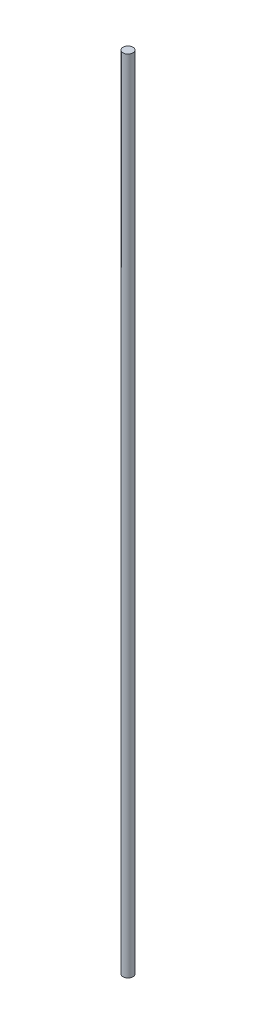
ISO-10303-21;
HEADER;
FILE_DESCRIPTION(('STEP AP214'),'2;1');
FILE_NAME('part.step','',(''),(''),'','','');
FILE_SCHEMA(('AUTOMOTIVE_DESIGN { 1 0 10303 214 1 1 1 1 }'));
ENDSEC;
DATA;
#1=APPLICATION_CONTEXT('core data for automotive mechanical design processes');
#2=APPLICATION_PROTOCOL_DEFINITION('international standard','automotive_design',2000,#1);
#3=PRODUCT_CONTEXT('',#1,'mechanical');
#4=PRODUCT('Part','Part','',(#3));
#5=PRODUCT_RELATED_PRODUCT_CATEGORY('part','',(#4));
#6=PRODUCT_DEFINITION_FORMATION('','',#4);
#7=PRODUCT_DEFINITION_CONTEXT('part definition',#1,'design');
#8=PRODUCT_DEFINITION('design','',#6,#7);
#9=PRODUCT_DEFINITION_SHAPE('','',#8);
#10=(LENGTH_UNIT() NAMED_UNIT(*) SI_UNIT(.MILLI.,.METRE.));
#11=(NAMED_UNIT(*) PLANE_ANGLE_UNIT() SI_UNIT($,.RADIAN.));
#12=(NAMED_UNIT(*) SI_UNIT($,.STERADIAN.) SOLID_ANGLE_UNIT());
#13=UNCERTAINTY_MEASURE_WITH_UNIT(LENGTH_MEASURE(1.E-05),#10,'distance_accuracy_value','');
#14=(GEOMETRIC_REPRESENTATION_CONTEXT(3) GLOBAL_UNCERTAINTY_ASSIGNED_CONTEXT((#13)) GLOBAL_UNIT_ASSIGNED_CONTEXT((#10,
#11,#12)) REPRESENTATION_CONTEXT('',''));
#15=CARTESIAN_POINT('',(0.,0.,0.));
#16=DIRECTION('',(0.,0.,1.));
#17=DIRECTION('',(1.,0.,0.));
#18=AXIS2_PLACEMENT_3D('',#15,#16,#17);
#19=CARTESIAN_POINT('',(0.,482.6,0.));
#20=DIRECTION('',(0.,-1.,0.));
#21=DIRECTION('',(0.,0.,-1.));
#22=AXIS2_PLACEMENT_3D('',#19,#20,#21);
#23=CYLINDRICAL_SURFACE('',#22,5.969);
#24=CARTESIAN_POINT('',(0.,482.6,0.));
#25=DIRECTION('',(0.,1.,0.));
#26=DIRECTION('',(0.,0.,1.));
#27=AXIS2_PLACEMENT_3D('',#24,#25,#26);
#28=CIRCLE('',#27,5.969);
#29=CARTESIAN_POINT('',(0.,482.6,5.969));
#30=VERTEX_POINT('',#29);
#31=EDGE_CURVE('E10',#30,#30,#28,.T.);
#32=ORIENTED_EDGE('',*,*,#31,.F.);
#33=EDGE_LOOP('',(#32));
#34=FACE_BOUND('',#33,.T.);
#35=CARTESIAN_POINT('',(0.,-482.6,0.));
#36=DIRECTION('',(0.,1.,0.));
#37=DIRECTION('',(0.,0.,1.));
#38=AXIS2_PLACEMENT_3D('',#35,#36,#37);
#39=CIRCLE('',#38,5.969);
#40=CARTESIAN_POINT('',(0.,-482.6,5.969));
#41=VERTEX_POINT('',#40);
#42=EDGE_CURVE('E39',#41,#41,#39,.T.);
#43=ORIENTED_EDGE('',*,*,#42,.T.);
#44=EDGE_LOOP('',(#43));
#45=FACE_BOUND('',#44,.T.);
#46=ADVANCED_FACE('F36',(#34,#45),#23,.T.);
#47=CARTESIAN_POINT('',(0.,482.6,0.));
#48=DIRECTION('',(0.,1.,0.));
#49=DIRECTION('',(0.,0.,1.));
#50=AXIS2_PLACEMENT_3D('',#47,#48,#49);
#51=PLANE('',#50);
#52=ORIENTED_EDGE('',*,*,#31,.T.);
#53=EDGE_LOOP('',(#52));
#54=FACE_BOUND('',#53,.T.);
#55=ADVANCED_FACE('F53',(#54),#51,.T.);
#56=CARTESIAN_POINT('',(0.,-482.6,0.));
#57=DIRECTION('',(0.,1.,0.));
#58=DIRECTION('',(0.,0.,1.));
#59=AXIS2_PLACEMENT_3D('',#56,#57,#58);
#60=PLANE('',#59);
#61=ORIENTED_EDGE('',*,*,#42,.F.);
#62=EDGE_LOOP('',(#61));
#63=FACE_BOUND('',#62,.T.);
#64=ADVANCED_FACE('F51',(#63),#60,.F.);
#65=CLOSED_SHELL('',(#46,#55,#64));
#66=MANIFOLD_SOLID_BREP('B2',#65);
#67=ADVANCED_BREP_SHAPE_REPRESENTATION('',(#18,#66),#14);
#68=SHAPE_DEFINITION_REPRESENTATION(#9,#67);
ENDSEC;
END-ISO-10303-21;
